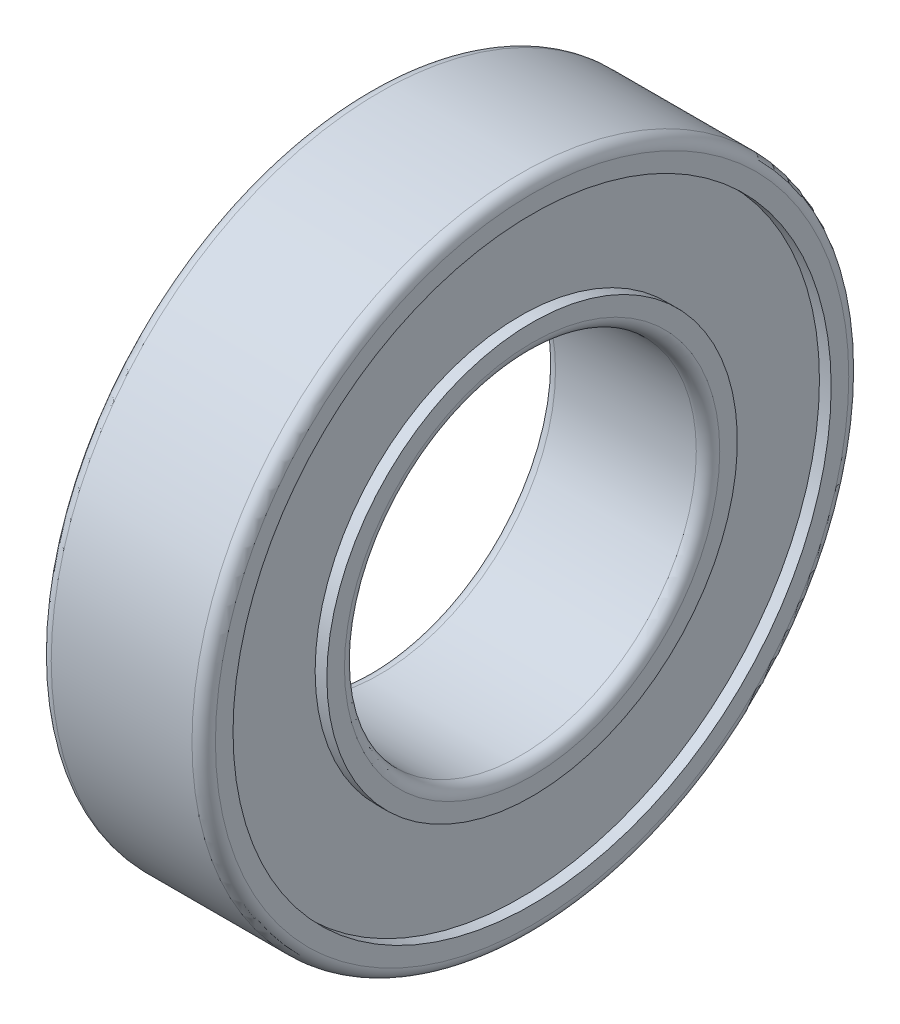
ISO-10303-21;
HEADER;
FILE_DESCRIPTION(('STEP AP214'),'2;1');
FILE_NAME('part.step','',(''),(''),'','','');
FILE_SCHEMA(('AUTOMOTIVE_DESIGN { 1 0 10303 214 1 1 1 1 }'));
ENDSEC;
DATA;
#1=APPLICATION_CONTEXT('core data for automotive mechanical design processes');
#2=APPLICATION_PROTOCOL_DEFINITION('international standard','automotive_design',2000,#1);
#3=PRODUCT_CONTEXT('',#1,'mechanical');
#4=PRODUCT('Part','Part','',(#3));
#5=PRODUCT_RELATED_PRODUCT_CATEGORY('part','',(#4));
#6=PRODUCT_DEFINITION_FORMATION('','',#4);
#7=PRODUCT_DEFINITION_CONTEXT('part definition',#1,'design');
#8=PRODUCT_DEFINITION('design','',#6,#7);
#9=PRODUCT_DEFINITION_SHAPE('','',#8);
#10=(LENGTH_UNIT() NAMED_UNIT(*) SI_UNIT(.MILLI.,.METRE.));
#11=(NAMED_UNIT(*) PLANE_ANGLE_UNIT() SI_UNIT($,.RADIAN.));
#12=(NAMED_UNIT(*) SI_UNIT($,.STERADIAN.) SOLID_ANGLE_UNIT());
#13=UNCERTAINTY_MEASURE_WITH_UNIT(LENGTH_MEASURE(1.E-05),#10,'distance_accuracy_value','');
#14=(GEOMETRIC_REPRESENTATION_CONTEXT(3) GLOBAL_UNCERTAINTY_ASSIGNED_CONTEXT((#13)) GLOBAL_UNIT_ASSIGNED_CONTEXT((#10,
#11,#12)) REPRESENTATION_CONTEXT('',''));
#15=CARTESIAN_POINT('',(0.,0.,0.));
#16=DIRECTION('',(0.,0.,1.));
#17=DIRECTION('',(1.,0.,0.));
#18=AXIS2_PLACEMENT_3D('',#15,#16,#17);
#19=CARTESIAN_POINT('',(0.5,12.75,0.));
#20=DIRECTION('',(1.,0.,0.));
#21=DIRECTION('',(0.,0.,-1.));
#22=AXIS2_PLACEMENT_3D('',#19,#20,#21);
#23=PLANE('',#22);
#24=CARTESIAN_POINT('',(0.5,0.,0.));
#25=DIRECTION('',(-1.,0.,0.));
#26=DIRECTION('',(0.,0.,1.));
#27=AXIS2_PLACEMENT_3D('',#24,#25,#26);
#28=CIRCLE('',#27,12.75);
#29=CARTESIAN_POINT('',(0.5,0.,12.75));
#30=VERTEX_POINT('',#29);
#31=EDGE_CURVE('E299',#30,#30,#28,.T.);
#32=ORIENTED_EDGE('',*,*,#31,.T.);
#33=EDGE_LOOP('',(#32));
#34=FACE_BOUND('',#33,.T.);
#35=CARTESIAN_POINT('',(0.5,0.,0.));
#36=DIRECTION('',(-1.,0.,0.));
#37=DIRECTION('',(0.,0.,1.));
#38=AXIS2_PLACEMENT_3D('',#35,#36,#37);
#39=CIRCLE('',#38,8.75);
#40=CARTESIAN_POINT('',(0.5,0.,8.75));
#41=VERTEX_POINT('',#40);
#42=EDGE_CURVE('E297',#41,#41,#39,.T.);
#43=ORIENTED_EDGE('',*,*,#42,.F.);
#44=EDGE_LOOP('',(#43));
#45=FACE_BOUND('',#44,.T.);
#46=ADVANCED_FACE('F17',(#34,#45),#23,.F.);
#47=CARTESIAN_POINT('',(0.,0.,0.));
#48=DIRECTION('',(-1.,0.,0.));
#49=DIRECTION('',(0.,0.,1.));
#50=AXIS2_PLACEMENT_3D('',#47,#48,#49);
#51=CYLINDRICAL_SURFACE('',#50,12.75);
#52=ORIENTED_EDGE('',*,*,#31,.F.);
#53=EDGE_LOOP('',(#52));
#54=FACE_BOUND('',#53,.T.);
#55=CARTESIAN_POINT('',(0.,0.,0.));
#56=DIRECTION('',(-1.,0.,0.));
#57=DIRECTION('',(0.,0.,1.));
#58=AXIS2_PLACEMENT_3D('',#55,#56,#57);
#59=CIRCLE('',#58,12.75);
#60=CARTESIAN_POINT('',(0.,0.,12.75));
#61=VERTEX_POINT('',#60);
#62=EDGE_CURVE('E294',#61,#61,#59,.T.);
#63=ORIENTED_EDGE('',*,*,#62,.T.);
#64=EDGE_LOOP('',(#63));
#65=FACE_BOUND('',#64,.T.);
#66=ADVANCED_FACE('F102',(#54,#65),#51,.F.);
#67=CARTESIAN_POINT('',(0.,0.,0.));
#68=DIRECTION('',(-1.,0.,0.));
#69=DIRECTION('',(0.,0.,1.));
#70=AXIS2_PLACEMENT_3D('',#67,#68,#69);
#71=CYLINDRICAL_SURFACE('',#70,8.75);
#72=CARTESIAN_POINT('',(0.,0.,0.));
#73=DIRECTION('',(-1.,0.,0.));
#74=DIRECTION('',(0.,0.,1.));
#75=AXIS2_PLACEMENT_3D('',#72,#73,#74);
#76=CIRCLE('',#75,8.75);
#77=CARTESIAN_POINT('',(0.,0.,8.75));
#78=VERTEX_POINT('',#77);
#79=EDGE_CURVE('E70',#78,#78,#76,.F.);
#80=ORIENTED_EDGE('',*,*,#79,.T.);
#81=EDGE_LOOP('',(#80));
#82=FACE_BOUND('',#81,.T.);
#83=ORIENTED_EDGE('',*,*,#42,.T.);
#84=EDGE_LOOP('',(#83));
#85=FACE_BOUND('',#84,.T.);
#86=ADVANCED_FACE('F90',(#82,#85),#71,.T.);
#87=CARTESIAN_POINT('',(0.,14.,0.));
#88=DIRECTION('',(1.,0.,0.));
#89=DIRECTION('',(0.,0.,-1.));
#90=AXIS2_PLACEMENT_3D('',#87,#88,#89);
#91=PLANE('',#90);
#92=ORIENTED_EDGE('',*,*,#62,.F.);
#93=EDGE_LOOP('',(#92));
#94=FACE_BOUND('',#93,.T.);
#95=CARTESIAN_POINT('',(0.,0.,0.));
#96=DIRECTION('',(1.,0.,0.));
#97=DIRECTION('',(0.,0.,-1.));
#98=AXIS2_PLACEMENT_3D('',#95,#96,#97);
#99=CIRCLE('',#98,13.5);
#100=CARTESIAN_POINT('',(0.,0.,-13.5));
#101=VERTEX_POINT('',#100);
#102=CARTESIAN_POINT('',(0.,0.,13.5));
#103=VERTEX_POINT('',#102);
#104=EDGE_CURVE('E57',#101,#103,#99,.T.);
#105=ORIENTED_EDGE('',*,*,#104,.F.);
#106=CARTESIAN_POINT('',(0.,0.,0.));
#107=DIRECTION('',(1.,0.,0.));
#108=DIRECTION('',(0.,0.,1.));
#109=AXIS2_PLACEMENT_3D('',#106,#107,#108);
#110=CIRCLE('',#109,13.5);
#111=EDGE_CURVE('E59',#103,#101,#110,.T.);
#112=ORIENTED_EDGE('',*,*,#111,.F.);
#113=EDGE_LOOP('',(#105,#112));
#114=FACE_BOUND('',#113,.T.);
#115=ADVANCED_FACE('F69',(#94,#114),#91,.F.);
#116=CARTESIAN_POINT('',(0.,8.75,0.));
#117=DIRECTION('',(1.,0.,0.));
#118=DIRECTION('',(0.,0.,-1.));
#119=AXIS2_PLACEMENT_3D('',#116,#117,#118);
#120=PLANE('',#119);
#121=ORIENTED_EDGE('',*,*,#79,.F.);
#122=EDGE_LOOP('',(#121));
#123=FACE_BOUND('',#122,.T.);
#124=CARTESIAN_POINT('',(0.,0.,0.));
#125=DIRECTION('',(-1.,0.,0.));
#126=DIRECTION('',(0.,0.,-1.));
#127=AXIS2_PLACEMENT_3D('',#124,#125,#126);
#128=CIRCLE('',#127,8.);
#129=CARTESIAN_POINT('',(0.,0.,-8.));
#130=VERTEX_POINT('',#129);
#131=CARTESIAN_POINT('',(0.,0.,8.));
#132=VERTEX_POINT('',#131);
#133=EDGE_CURVE('E65',#130,#132,#128,.T.);
#134=ORIENTED_EDGE('',*,*,#133,.F.);
#135=CARTESIAN_POINT('',(0.,0.,0.));
#136=DIRECTION('',(-1.,0.,0.));
#137=DIRECTION('',(0.,0.,1.));
#138=AXIS2_PLACEMENT_3D('',#135,#136,#137);
#139=CIRCLE('',#138,8.);
#140=EDGE_CURVE('E241',#132,#130,#139,.T.);
#141=ORIENTED_EDGE('',*,*,#140,.F.);
#142=EDGE_LOOP('',(#134,#141));
#143=FACE_BOUND('',#142,.T.);
#144=ADVANCED_FACE('F89',(#123,#143),#120,.F.);
#145=CARTESIAN_POINT('',(0.500000000000002,0.,0.));
#146=DIRECTION('',(1.,0.,0.));
#147=DIRECTION('',(0.,0.,-1.));
#148=AXIS2_PLACEMENT_3D('',#145,#146,#147);
#149=TOROIDAL_SURFACE('',#148,13.5,0.5);
#150=ORIENTED_EDGE('',*,*,#104,.T.);
#151=ORIENTED_EDGE('',*,*,#111,.T.);
#152=EDGE_LOOP('',(#150,#151));
#153=FACE_BOUND('',#152,.T.);
#154=CARTESIAN_POINT('',(0.500000000000002,0.,0.));
#155=DIRECTION('',(-1.,0.,0.));
#156=DIRECTION('',(0.,0.,1.));
#157=AXIS2_PLACEMENT_3D('',#154,#155,#156);
#158=CIRCLE('',#157,14.);
#159=CARTESIAN_POINT('',(0.500000000000002,0.,14.));
#160=VERTEX_POINT('',#159);
#161=EDGE_CURVE('E238',#160,#160,#158,.F.);
#162=ORIENTED_EDGE('',*,*,#161,.F.);
#163=EDGE_LOOP('',(#162));
#164=FACE_BOUND('',#163,.T.);
#165=ADVANCED_FACE('F61',(#153,#164),#149,.T.);
#166=CARTESIAN_POINT('',(0.5,0.,0.));
#167=DIRECTION('',(1.,0.,0.));
#168=DIRECTION('',(0.,0.,-1.));
#169=AXIS2_PLACEMENT_3D('',#166,#167,#168);
#170=TOROIDAL_SURFACE('',#169,8.,0.5);
#171=ORIENTED_EDGE('',*,*,#133,.T.);
#172=ORIENTED_EDGE('',*,*,#140,.T.);
#173=EDGE_LOOP('',(#171,#172));
#174=FACE_BOUND('',#173,.T.);
#175=CARTESIAN_POINT('',(0.5,0.,0.));
#176=DIRECTION('',(-1.,0.,0.));
#177=DIRECTION('',(0.,0.,1.));
#178=AXIS2_PLACEMENT_3D('',#175,#176,#177);
#179=CIRCLE('',#178,7.5);
#180=CARTESIAN_POINT('',(0.5,0.,7.5));
#181=VERTEX_POINT('',#180);
#182=EDGE_CURVE('E234',#181,#181,#179,.F.);
#183=ORIENTED_EDGE('',*,*,#182,.T.);
#184=EDGE_LOOP('',(#183));
#185=FACE_BOUND('',#184,.T.);
#186=ADVANCED_FACE('F218',(#174,#185),#170,.T.);
#187=CARTESIAN_POINT('',(0.,0.,0.));
#188=DIRECTION('',(-1.,0.,0.));
#189=DIRECTION('',(0.,0.,1.));
#190=AXIS2_PLACEMENT_3D('',#187,#188,#189);
#191=CYLINDRICAL_SURFACE('',#190,14.);
#192=CARTESIAN_POINT('',(6.5,0.,0.));
#193=DIRECTION('',(-1.,0.,0.));
#194=DIRECTION('',(0.,0.,1.));
#195=AXIS2_PLACEMENT_3D('',#192,#193,#194);
#196=CIRCLE('',#195,14.);
#197=CARTESIAN_POINT('',(6.5,0.,14.));
#198=VERTEX_POINT('',#197);
#199=EDGE_CURVE('E264',#198,#198,#196,.F.);
#200=ORIENTED_EDGE('',*,*,#199,.F.);
#201=EDGE_LOOP('',(#200));
#202=FACE_BOUND('',#201,.T.);
#203=ORIENTED_EDGE('',*,*,#161,.T.);
#204=EDGE_LOOP('',(#203));
#205=FACE_BOUND('',#204,.T.);
#206=ADVANCED_FACE('F228',(#202,#205),#191,.T.);
#207=CARTESIAN_POINT('',(0.,0.,0.));
#208=DIRECTION('',(-1.,0.,0.));
#209=DIRECTION('',(0.,0.,1.));
#210=AXIS2_PLACEMENT_3D('',#207,#208,#209);
#211=CYLINDRICAL_SURFACE('',#210,7.5);
#212=CARTESIAN_POINT('',(6.5,0.,0.));
#213=DIRECTION('',(-1.,0.,0.));
#214=DIRECTION('',(0.,0.,1.));
#215=AXIS2_PLACEMENT_3D('',#212,#213,#214);
#216=CIRCLE('',#215,7.5);
#217=CARTESIAN_POINT('',(6.5,0.,7.5));
#218=VERTEX_POINT('',#217);
#219=EDGE_CURVE('E266',#218,#218,#216,.T.);
#220=ORIENTED_EDGE('',*,*,#219,.F.);
#221=EDGE_LOOP('',(#220));
#222=FACE_BOUND('',#221,.T.);
#223=ORIENTED_EDGE('',*,*,#182,.F.);
#224=EDGE_LOOP('',(#223));
#225=FACE_BOUND('',#224,.T.);
#226=ADVANCED_FACE('F325',(#222,#225),#211,.F.);
#227=CARTESIAN_POINT('',(6.5,0.,0.));
#228=DIRECTION('',(-1.,0.,0.));
#229=DIRECTION('',(0.,0.,1.));
#230=AXIS2_PLACEMENT_3D('',#227,#228,#229);
#231=TOROIDAL_SURFACE('',#230,13.5,0.5);
#232=CARTESIAN_POINT('',(7.,0.,0.));
#233=DIRECTION('',(-1.,0.,0.));
#234=DIRECTION('',(0.,0.,1.));
#235=AXIS2_PLACEMENT_3D('',#232,#233,#234);
#236=CIRCLE('',#235,13.5);
#237=CARTESIAN_POINT('',(7.,0.,13.5));
#238=VERTEX_POINT('',#237);
#239=CARTESIAN_POINT('',(7.,0.,-13.5));
#240=VERTEX_POINT('',#239);
#241=EDGE_CURVE('E156',#238,#240,#236,.T.);
#242=ORIENTED_EDGE('',*,*,#241,.T.);
#243=CARTESIAN_POINT('',(7.,0.,0.));
#244=DIRECTION('',(-1.,0.,0.));
#245=DIRECTION('',(0.,0.,-1.));
#246=AXIS2_PLACEMENT_3D('',#243,#244,#245);
#247=CIRCLE('',#246,13.5);
#248=EDGE_CURVE('E167',#240,#238,#247,.T.);
#249=ORIENTED_EDGE('',*,*,#248,.T.);
#250=EDGE_LOOP('',(#242,#249));
#251=FACE_BOUND('',#250,.T.);
#252=ORIENTED_EDGE('',*,*,#199,.T.);
#253=EDGE_LOOP('',(#252));
#254=FACE_BOUND('',#253,.T.);
#255=ADVANCED_FACE('F183',(#251,#254),#231,.T.);
#256=CARTESIAN_POINT('',(6.5,0.,0.));
#257=DIRECTION('',(-1.,0.,0.));
#258=DIRECTION('',(0.,0.,1.));
#259=AXIS2_PLACEMENT_3D('',#256,#257,#258);
#260=TOROIDAL_SURFACE('',#259,8.,0.5);
#261=CARTESIAN_POINT('',(7.,0.,0.));
#262=DIRECTION('',(1.,0.,0.));
#263=DIRECTION('',(0.,0.,1.));
#264=AXIS2_PLACEMENT_3D('',#261,#262,#263);
#265=CIRCLE('',#264,8.);
#266=CARTESIAN_POINT('',(7.,0.,8.));
#267=VERTEX_POINT('',#266);
#268=CARTESIAN_POINT('',(7.,0.,-8.));
#269=VERTEX_POINT('',#268);
#270=EDGE_CURVE('E281',#267,#269,#265,.T.);
#271=ORIENTED_EDGE('',*,*,#270,.T.);
#272=CARTESIAN_POINT('',(7.,0.,0.));
#273=DIRECTION('',(1.,0.,0.));
#274=DIRECTION('',(0.,0.,-1.));
#275=AXIS2_PLACEMENT_3D('',#272,#273,#274);
#276=CIRCLE('',#275,8.);
#277=EDGE_CURVE('E36',#269,#267,#276,.T.);
#278=ORIENTED_EDGE('',*,*,#277,.T.);
#279=EDGE_LOOP('',(#271,#278));
#280=FACE_BOUND('',#279,.T.);
#281=ORIENTED_EDGE('',*,*,#219,.T.);
#282=EDGE_LOOP('',(#281));
#283=FACE_BOUND('',#282,.T.);
#284=ADVANCED_FACE('F179',(#280,#283),#260,.T.);
#285=CARTESIAN_POINT('',(7.,12.75,0.));
#286=DIRECTION('',(-1.,0.,0.));
#287=DIRECTION('',(0.,0.,1.));
#288=AXIS2_PLACEMENT_3D('',#285,#286,#287);
#289=PLANE('',#288);
#290=CARTESIAN_POINT('',(7.,0.,0.));
#291=DIRECTION('',(-1.,0.,0.));
#292=DIRECTION('',(0.,0.,1.));
#293=AXIS2_PLACEMENT_3D('',#290,#291,#292);
#294=CIRCLE('',#293,12.75);
#295=CARTESIAN_POINT('',(7.,0.,12.75));
#296=VERTEX_POINT('',#295);
#297=EDGE_CURVE('E282',#296,#296,#294,.T.);
#298=ORIENTED_EDGE('',*,*,#297,.T.);
#299=EDGE_LOOP('',(#298));
#300=FACE_BOUND('',#299,.T.);
#301=ORIENTED_EDGE('',*,*,#241,.F.);
#302=ORIENTED_EDGE('',*,*,#248,.F.);
#303=EDGE_LOOP('',(#301,#302));
#304=FACE_BOUND('',#303,.T.);
#305=ADVANCED_FACE('F135',(#300,#304),#289,.F.);
#306=CARTESIAN_POINT('',(7.,7.5,0.));
#307=DIRECTION('',(-1.,0.,0.));
#308=DIRECTION('',(0.,0.,1.));
#309=AXIS2_PLACEMENT_3D('',#306,#307,#308);
#310=PLANE('',#309);
#311=CARTESIAN_POINT('',(7.,0.,0.));
#312=DIRECTION('',(-1.,0.,0.));
#313=DIRECTION('',(0.,0.,1.));
#314=AXIS2_PLACEMENT_3D('',#311,#312,#313);
#315=CIRCLE('',#314,8.75);
#316=CARTESIAN_POINT('',(7.,0.,8.75));
#317=VERTEX_POINT('',#316);
#318=EDGE_CURVE('E284',#317,#317,#315,.T.);
#319=ORIENTED_EDGE('',*,*,#318,.F.);
#320=EDGE_LOOP('',(#319));
#321=FACE_BOUND('',#320,.T.);
#322=ORIENTED_EDGE('',*,*,#270,.F.);
#323=ORIENTED_EDGE('',*,*,#277,.F.);
#324=EDGE_LOOP('',(#322,#323));
#325=FACE_BOUND('',#324,.T.);
#326=ADVANCED_FACE('F130',(#321,#325),#310,.F.);
#327=CARTESIAN_POINT('',(0.,0.,0.));
#328=DIRECTION('',(-1.,0.,0.));
#329=DIRECTION('',(0.,0.,1.));
#330=AXIS2_PLACEMENT_3D('',#327,#328,#329);
#331=CYLINDRICAL_SURFACE('',#330,12.75);
#332=ORIENTED_EDGE('',*,*,#297,.F.);
#333=EDGE_LOOP('',(#332));
#334=FACE_BOUND('',#333,.T.);
#335=CARTESIAN_POINT('',(6.5,0.,0.));
#336=DIRECTION('',(-1.,0.,0.));
#337=DIRECTION('',(0.,0.,1.));
#338=AXIS2_PLACEMENT_3D('',#335,#336,#337);
#339=CIRCLE('',#338,12.75);
#340=CARTESIAN_POINT('',(6.5,0.,12.75));
#341=VERTEX_POINT('',#340);
#342=EDGE_CURVE('E28',#341,#341,#339,.T.);
#343=ORIENTED_EDGE('',*,*,#342,.T.);
#344=EDGE_LOOP('',(#343));
#345=FACE_BOUND('',#344,.T.);
#346=ADVANCED_FACE('F122',(#334,#345),#331,.F.);
#347=CARTESIAN_POINT('',(0.,0.,0.));
#348=DIRECTION('',(-1.,0.,0.));
#349=DIRECTION('',(0.,0.,1.));
#350=AXIS2_PLACEMENT_3D('',#347,#348,#349);
#351=CYLINDRICAL_SURFACE('',#350,8.75);
#352=CARTESIAN_POINT('',(6.5,0.,0.));
#353=DIRECTION('',(-1.,0.,0.));
#354=DIRECTION('',(0.,0.,1.));
#355=AXIS2_PLACEMENT_3D('',#352,#353,#354);
#356=CIRCLE('',#355,8.75);
#357=CARTESIAN_POINT('',(6.5,0.,8.75));
#358=VERTEX_POINT('',#357);
#359=EDGE_CURVE('E11',#358,#358,#356,.F.);
#360=ORIENTED_EDGE('',*,*,#359,.T.);
#361=EDGE_LOOP('',(#360));
#362=FACE_BOUND('',#361,.T.);
#363=ORIENTED_EDGE('',*,*,#318,.T.);
#364=EDGE_LOOP('',(#363));
#365=FACE_BOUND('',#364,.T.);
#366=ADVANCED_FACE('F116',(#362,#365),#351,.T.);
#367=CARTESIAN_POINT('',(6.5,8.75,0.));
#368=DIRECTION('',(-1.,0.,0.));
#369=DIRECTION('',(0.,0.,1.));
#370=AXIS2_PLACEMENT_3D('',#367,#368,#369);
#371=PLANE('',#370);
#372=ORIENTED_EDGE('',*,*,#359,.F.);
#373=EDGE_LOOP('',(#372));
#374=FACE_BOUND('',#373,.T.);
#375=ORIENTED_EDGE('',*,*,#342,.F.);
#376=EDGE_LOOP('',(#375));
#377=FACE_BOUND('',#376,.T.);
#378=ADVANCED_FACE('F114',(#374,#377),#371,.F.);
#379=CLOSED_SHELL('',(#46,#66,#86,#115,#144,#165,#186,#206,#226,#255,#284,#305,#326,#346,#366,#378));
#380=MANIFOLD_SOLID_BREP('B1',#379);
#381=ADVANCED_BREP_SHAPE_REPRESENTATION('',(#18,#380),#14);
#382=SHAPE_DEFINITION_REPRESENTATION(#9,#381);
ENDSEC;
END-ISO-10303-21;
